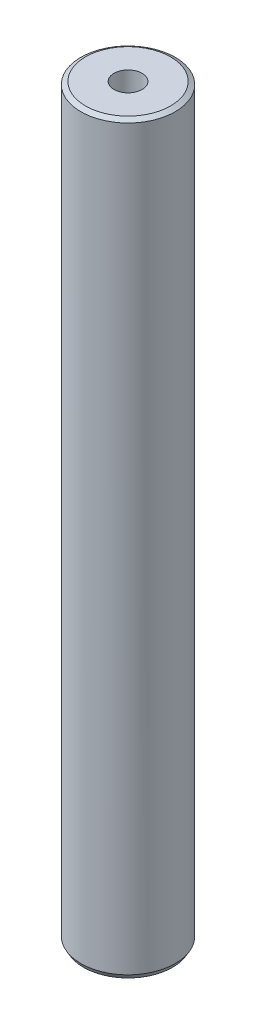
ISO-10303-21;
HEADER;
FILE_DESCRIPTION(('STEP AP214'),'2;1');
FILE_NAME('part.step','',(''),(''),'','','');
FILE_SCHEMA(('AUTOMOTIVE_DESIGN { 1 0 10303 214 1 1 1 1 }'));
ENDSEC;
DATA;
#1=APPLICATION_CONTEXT('core data for automotive mechanical design processes');
#2=APPLICATION_PROTOCOL_DEFINITION('international standard','automotive_design',2000,#1);
#3=PRODUCT_CONTEXT('',#1,'mechanical');
#4=PRODUCT('Part','Part','',(#3));
#5=PRODUCT_RELATED_PRODUCT_CATEGORY('part','',(#4));
#6=PRODUCT_DEFINITION_FORMATION('','',#4);
#7=PRODUCT_DEFINITION_CONTEXT('part definition',#1,'design');
#8=PRODUCT_DEFINITION('design','',#6,#7);
#9=PRODUCT_DEFINITION_SHAPE('','',#8);
#10=(LENGTH_UNIT() NAMED_UNIT(*) SI_UNIT(.MILLI.,.METRE.));
#11=(NAMED_UNIT(*) PLANE_ANGLE_UNIT() SI_UNIT($,.RADIAN.));
#12=(NAMED_UNIT(*) SI_UNIT($,.STERADIAN.) SOLID_ANGLE_UNIT());
#13=UNCERTAINTY_MEASURE_WITH_UNIT(LENGTH_MEASURE(1.E-05),#10,'distance_accuracy_value','');
#14=(GEOMETRIC_REPRESENTATION_CONTEXT(3) GLOBAL_UNCERTAINTY_ASSIGNED_CONTEXT((#13)) GLOBAL_UNIT_ASSIGNED_CONTEXT((#10,
#11,#12)) REPRESENTATION_CONTEXT('',''));
#15=CARTESIAN_POINT('',(0.,0.,0.));
#16=DIRECTION('',(0.,0.,1.));
#17=DIRECTION('',(1.,0.,0.));
#18=AXIS2_PLACEMENT_3D('',#15,#16,#17);
#19=CARTESIAN_POINT('',(0.,591.938683053049,0.));
#20=DIRECTION('',(0.,-1.,0.));
#21=DIRECTION('',(0.,0.,-1.));
#22=AXIS2_PLACEMENT_3D('',#19,#20,#21);
#23=CYLINDRICAL_SURFACE('',#22,37.5);
#24=CARTESIAN_POINT('',(0.,589.81200733896,0.));
#25=DIRECTION('',(0.,1.,0.));
#26=DIRECTION('',(0.,0.,1.));
#27=AXIS2_PLACEMENT_3D('',#24,#25,#26);
#28=CIRCLE('',#27,37.5);
#29=CARTESIAN_POINT('',(0.,589.81200733896,-37.5));
#30=VERTEX_POINT('',#29);
#31=EDGE_CURVE('E50',#30,#30,#28,.F.);
#32=CARTESIAN_POINT('',(0.,3.70015920661737,0.));
#33=DIRECTION('',(0.,1.,0.));
#34=DIRECTION('',(0.,0.,1.));
#35=AXIS2_PLACEMENT_3D('',#32,#33,#34);
#36=CIRCLE('',#35,37.5);
#37=CARTESIAN_POINT('',(0.,3.70015920661737,-37.5));
#38=VERTEX_POINT('',#37);
#39=EDGE_CURVE('E51',#38,#38,#36,.T.);
#40=CARTESIAN_POINT('',(0.,589.81200733896,-37.5));
#41=CARTESIAN_POINT('',(0.,583.706675587581,-37.5));
#42=CARTESIAN_POINT('',(0.,577.601343836203,-37.5));
#43=CARTESIAN_POINT('',(0.,565.390680333446,-37.5));
#44=CARTESIAN_POINT('',(0.,559.285348582067,-37.5));
#45=CARTESIAN_POINT('',(0.,547.07468507931,-37.5));
#46=CARTESIAN_POINT('',(0.,540.969353327931,-37.5));
#47=CARTESIAN_POINT('',(0.,528.758689825174,-37.5));
#48=CARTESIAN_POINT('',(0.,522.653358073796,-37.5));
#49=CARTESIAN_POINT('',(0.,510.442694571039,-37.5));
#50=CARTESIAN_POINT('',(0.,504.33736281966,-37.5));
#51=CARTESIAN_POINT('',(0.,492.126699316903,-37.5));
#52=CARTESIAN_POINT('',(0.,486.021367565524,-37.5));
#53=CARTESIAN_POINT('',(0.,473.810704062767,-37.5));
#54=CARTESIAN_POINT('',(0.,467.705372311389,-37.5));
#55=CARTESIAN_POINT('',(0.,455.494708808632,-37.5));
#56=CARTESIAN_POINT('',(0.,449.389377057253,-37.5));
#57=CARTESIAN_POINT('',(0.,437.178713554496,-37.5));
#58=CARTESIAN_POINT('',(0.,431.073381803117,-37.5));
#59=CARTESIAN_POINT('',(0.,418.86271830036,-37.5));
#60=CARTESIAN_POINT('',(0.,412.757386548982,-37.5));
#61=CARTESIAN_POINT('',(0.,400.546723046224,-37.5));
#62=CARTESIAN_POINT('',(0.,394.441391294846,-37.5));
#63=CARTESIAN_POINT('',(0.,382.230727792089,-37.5));
#64=CARTESIAN_POINT('',(0.,376.12539604071,-37.5));
#65=CARTESIAN_POINT('',(0.,363.914732537953,-37.5));
#66=CARTESIAN_POINT('',(0.,357.809400786574,-37.5));
#67=CARTESIAN_POINT('',(0.,345.598737283817,-37.5));
#68=CARTESIAN_POINT('',(0.,339.493405532439,-37.5));
#69=CARTESIAN_POINT('',(0.,327.282742029682,-37.5));
#70=CARTESIAN_POINT('',(0.,321.177410278303,-37.5));
#71=CARTESIAN_POINT('',(0.,308.966746775546,-37.5));
#72=CARTESIAN_POINT('',(0.,302.861415024167,-37.5));
#73=CARTESIAN_POINT('',(0.,290.65075152141,-37.5));
#74=CARTESIAN_POINT('',(0.,284.545419770032,-37.5));
#75=CARTESIAN_POINT('',(0.,272.334756267274,-37.5));
#76=CARTESIAN_POINT('',(0.,266.229424515896,-37.5));
#77=CARTESIAN_POINT('',(0.,254.018761013139,-37.5));
#78=CARTESIAN_POINT('',(0.,247.91342926176,-37.5));
#79=CARTESIAN_POINT('',(0.,235.702765759003,-37.5));
#80=CARTESIAN_POINT('',(0.,229.597434007624,-37.5));
#81=CARTESIAN_POINT('',(0.,217.386770504867,-37.5));
#82=CARTESIAN_POINT('',(0.,211.281438753489,-37.5));
#83=CARTESIAN_POINT('',(0.,199.070775250732,-37.5));
#84=CARTESIAN_POINT('',(0.,192.965443499353,-37.5));
#85=CARTESIAN_POINT('',(0.,180.754779996596,-37.5));
#86=CARTESIAN_POINT('',(0.,174.649448245217,-37.5));
#87=CARTESIAN_POINT('',(0.,162.43878474246,-37.5));
#88=CARTESIAN_POINT('',(0.,156.333452991082,-37.5));
#89=CARTESIAN_POINT('',(0.,144.122789488324,-37.5));
#90=CARTESIAN_POINT('',(0.,138.017457736946,-37.5));
#91=CARTESIAN_POINT('',(0.,125.806794234189,-37.5));
#92=CARTESIAN_POINT('',(0.,119.70146248281,-37.5));
#93=CARTESIAN_POINT('',(0.,107.490798980053,-37.5));
#94=CARTESIAN_POINT('',(0.,101.385467228674,-37.5));
#95=CARTESIAN_POINT('',(0.,89.1748037259174,-37.5));
#96=CARTESIAN_POINT('',(0.,83.0694719745388,-37.5));
#97=CARTESIAN_POINT('',(0.,70.8588084717817,-37.5));
#98=CARTESIAN_POINT('',(0.,64.7534767204031,-37.5));
#99=CARTESIAN_POINT('',(0.,52.5428132176459,-37.5));
#100=CARTESIAN_POINT('',(0.,46.4374814662673,-37.5));
#101=CARTESIAN_POINT('',(0.,34.2268179635102,-37.5));
#102=CARTESIAN_POINT('',(0.,28.1214862121317,-37.5));
#103=CARTESIAN_POINT('',(0.,15.9108227093745,-37.5));
#104=CARTESIAN_POINT('',(0.,9.80549095799594,-37.5));
#105=CARTESIAN_POINT('',(0.,3.70015920661737,-37.5));
#106=B_SPLINE_CURVE_WITH_KNOTS('',3,(#40,#41,#42,#43,#44,#45,#46,#47,#48,#49,#50,#51,#52,#53,
#54,#55,#56,#57,#58,#59,#60,#61,#62,#63,#64,#65,#66,#67,#68,#69,#70,#71,#72,#73,#74,#75,#76,#77,
#78,#79,#80,#81,#82,#83,#84,#85,#86,#87,#88,#89,#90,#91,#92,#93,#94,#95,#96,#97,#98,#99,#100,
#101,#102,#103,#104,#105),.UNSPECIFIED.,.F.,.F.,(4,2,2,2,2,2,2,2,2,2,2,2,2,2,2,2,2,2,2,2,2,2,2,
2,2,2,2,2,2,2,2,2,4),(0.,18.3159952541356,36.6319905082714,54.9479857624071,73.2639810165427,
91.5799762706785,109.895971524814,128.21196677895,146.527962033086,164.843957287221,
183.159952541357,201.475947795493,219.791943049628,238.107938303764,256.4239335579,
274.739928812036,293.055924066171,311.371919320307,329.687914574443,348.003909828578,
366.319905082714,384.63590033685,402.951895590986,421.267890845121,439.583886099257,
457.899881353393,476.215876607528,494.531871861664,512.8478671158,531.163862369935,
549.479857624071,567.795852878207,586.111848132343),.UNSPECIFIED.);
#107=EDGE_CURVE('BSEAM39',#30,#38,#106,.T.);
#108=ORIENTED_EDGE('',*,*,#31,.T.);
#109=ORIENTED_EDGE('',*,*,#39,.T.);
#110=ORIENTED_EDGE('',*,*,#107,.T.);
#111=ORIENTED_EDGE('',*,*,#107,.F.);
#112=EDGE_LOOP('',(#108,#110,#109,#111));
#113=FACE_BOUND('',#112,.T.);
#114=ADVANCED_FACE('F39',(#113),#23,.T.);
#115=CARTESIAN_POINT('',(0.,591.938683053049,0.));
#116=DIRECTION('',(0.,1.,0.));
#117=DIRECTION('',(0.,0.,1.));
#118=AXIS2_PLACEMENT_3D('',#115,#116,#117);
#119=PLANE('',#118);
#120=CARTESIAN_POINT('',(0.,591.938683053049,0.));
#121=DIRECTION('',(0.,1.,0.));
#122=DIRECTION('',(0.,0.,1.));
#123=AXIS2_PLACEMENT_3D('',#120,#121,#122);
#124=CIRCLE('',#123,33.7998407933843);
#125=CARTESIAN_POINT('',(0.,591.938683053049,33.7998407933843));
#126=VERTEX_POINT('',#125);
#127=EDGE_CURVE('E54',#126,#126,#124,.T.);
#128=ORIENTED_EDGE('',*,*,#127,.T.);
#129=EDGE_LOOP('',(#128));
#130=FACE_BOUND('',#129,.T.);
#131=CARTESIAN_POINT('',(0.,591.938683053049,0.));
#132=DIRECTION('',(0.,1.,0.));
#133=DIRECTION('',(0.,0.,1.));
#134=AXIS2_PLACEMENT_3D('',#131,#132,#133);
#135=CIRCLE('',#134,11.1779495084314);
#136=CARTESIAN_POINT('',(0.,591.938683053049,-11.1779495084314));
#137=VERTEX_POINT('',#136);
#138=EDGE_CURVE('E58',#137,#137,#135,.T.);
#139=ORIENTED_EDGE('',*,*,#138,.F.);
#140=EDGE_LOOP('',(#139));
#141=FACE_BOUND('',#140,.T.);
#142=ADVANCED_FACE('F69',(#130,#141),#119,.T.);
#143=CARTESIAN_POINT('',(0.,0.,0.));
#144=DIRECTION('',(0.,1.,0.));
#145=DIRECTION('',(0.,0.,1.));
#146=AXIS2_PLACEMENT_3D('',#143,#144,#145);
#147=PLANE('',#146);
#148=CARTESIAN_POINT('',(0.,0.,0.));
#149=DIRECTION('',(0.,1.,0.));
#150=DIRECTION('',(0.,0.,1.));
#151=AXIS2_PLACEMENT_3D('',#148,#149,#150);
#152=CIRCLE('',#151,35.3733242859099);
#153=CARTESIAN_POINT('',(0.,0.,35.3733242859099));
#154=VERTEX_POINT('',#153);
#155=EDGE_CURVE('E10',#154,#154,#152,.F.);
#156=ORIENTED_EDGE('',*,*,#155,.T.);
#157=EDGE_LOOP('',(#156));
#158=FACE_BOUND('',#157,.T.);
#159=CARTESIAN_POINT('',(0.,0.,0.));
#160=DIRECTION('',(0.,1.,0.));
#161=DIRECTION('',(0.,0.,1.));
#162=AXIS2_PLACEMENT_3D('',#159,#160,#161);
#163=CIRCLE('',#162,11.1779495084314);
#164=CARTESIAN_POINT('',(0.,-1.11022302462516E-13,-11.1779495084314));
#165=VERTEX_POINT('',#164);
#166=EDGE_CURVE('E63',#165,#165,#163,.T.);
#167=ORIENTED_EDGE('',*,*,#166,.T.);
#168=EDGE_LOOP('',(#167));
#169=FACE_BOUND('',#168,.T.);
#170=ADVANCED_FACE('F75',(#158,#169),#147,.F.);
#171=CARTESIAN_POINT('',(0.,591.938683053049,0.));
#172=DIRECTION('',(0.,-1.,0.));
#173=DIRECTION('',(0.,0.,-1.));
#174=AXIS2_PLACEMENT_3D('',#171,#172,#173);
#175=CYLINDRICAL_SURFACE('',#174,11.1779495084314);
#176=CARTESIAN_POINT('',(0.,591.938683053049,-11.1779495084314));
#177=CARTESIAN_POINT('',(0.,585.77265510458,-11.1779495084314));
#178=CARTESIAN_POINT('',(0.,579.606627156111,-11.1779495084314));
#179=CARTESIAN_POINT('',(0.,567.274571259172,-11.1779495084314));
#180=CARTESIAN_POINT('',(0.,561.108543310703,-11.1779495084314));
#181=CARTESIAN_POINT('',(0.,548.776487413764,-11.1779495084314));
#182=CARTESIAN_POINT('',(0.,542.610459465295,-11.1779495084314));
#183=CARTESIAN_POINT('',(0.,530.278403568357,-11.1779495084314));
#184=CARTESIAN_POINT('',(0.,524.112375619887,-11.1779495084314));
#185=CARTESIAN_POINT('',(0.,511.780319722949,-11.1779495084314));
#186=CARTESIAN_POINT('',(0.,505.61429177448,-11.1779495084314));
#187=CARTESIAN_POINT('',(0.,493.282235877541,-11.1779495084314));
#188=CARTESIAN_POINT('',(0.,487.116207929072,-11.1779495084314));
#189=CARTESIAN_POINT('',(0.,474.784152032133,-11.1779495084314));
#190=CARTESIAN_POINT('',(0.,468.618124083664,-11.1779495084314));
#191=CARTESIAN_POINT('',(0.,456.286068186725,-11.1779495084314));
#192=CARTESIAN_POINT('',(0.,450.120040238256,-11.1779495084314));
#193=CARTESIAN_POINT('',(0.,437.787984341318,-11.1779495084314));
#194=CARTESIAN_POINT('',(0.,431.621956392848,-11.1779495084314));
#195=CARTESIAN_POINT('',(0.,419.28990049591,-11.1779495084314));
#196=CARTESIAN_POINT('',(0.,413.123872547441,-11.1779495084314));
#197=CARTESIAN_POINT('',(0.,400.791816650502,-11.1779495084314));
#198=CARTESIAN_POINT('',(0.,394.625788702033,-11.1779495084314));
#199=CARTESIAN_POINT('',(0.,382.293732805094,-11.1779495084314));
#200=CARTESIAN_POINT('',(0.,376.127704856625,-11.1779495084314));
#201=CARTESIAN_POINT('',(0.,363.795648959686,-11.1779495084314));
#202=CARTESIAN_POINT('',(0.,357.629621011217,-11.1779495084314));
#203=CARTESIAN_POINT('',(0.,345.297565114279,-11.1779495084314));
#204=CARTESIAN_POINT('',(0.,339.131537165809,-11.1779495084314));
#205=CARTESIAN_POINT('',(0.,326.799481268871,-11.1779495084314));
#206=CARTESIAN_POINT('',(0.,320.633453320402,-11.1779495084314));
#207=CARTESIAN_POINT('',(0.,308.301397423463,-11.1779495084314));
#208=CARTESIAN_POINT('',(0.,302.135369474994,-11.1779495084314));
#209=CARTESIAN_POINT('',(0.,289.803313578055,-11.1779495084314));
#210=CARTESIAN_POINT('',(0.,283.637285629586,-11.1779495084314));
#211=CARTESIAN_POINT('',(0.,271.305229732647,-11.1779495084314));
#212=CARTESIAN_POINT('',(0.,265.139201784178,-11.1779495084314));
#213=CARTESIAN_POINT('',(0.,252.80714588724,-11.1779495084314));
#214=CARTESIAN_POINT('',(0.,246.64111793877,-11.1779495084314));
#215=CARTESIAN_POINT('',(0.,234.309062041832,-11.1779495084314));
#216=CARTESIAN_POINT('',(0.,228.143034093363,-11.1779495084314));
#217=CARTESIAN_POINT('',(0.,215.810978196424,-11.1779495084314));
#218=CARTESIAN_POINT('',(0.,209.644950247955,-11.1779495084314));
#219=CARTESIAN_POINT('',(0.,197.312894351016,-11.1779495084314));
#220=CARTESIAN_POINT('',(0.,191.146866402547,-11.1779495084314));
#221=CARTESIAN_POINT('',(0.,178.814810505608,-11.1779495084314));
#222=CARTESIAN_POINT('',(0.,172.648782557139,-11.1779495084314));
#223=CARTESIAN_POINT('',(0.,160.316726660201,-11.1779495084314));
#224=CARTESIAN_POINT('',(0.,154.150698711731,-11.1779495084314));
#225=CARTESIAN_POINT('',(0.,141.818642814793,-11.1779495084314));
#226=CARTESIAN_POINT('',(0.,135.652614866324,-11.1779495084314));
#227=CARTESIAN_POINT('',(0.,123.320558969385,-11.1779495084314));
#228=CARTESIAN_POINT('',(0.,117.154531020916,-11.1779495084314));
#229=CARTESIAN_POINT('',(0.,104.822475123977,-11.1779495084314));
#230=CARTESIAN_POINT('',(0.,98.656447175508,-11.1779495084314));
#231=CARTESIAN_POINT('',(0.,86.3243912785695,-11.1779495084314));
#232=CARTESIAN_POINT('',(0.,80.1583633301003,-11.1779495084314));
#233=CARTESIAN_POINT('',(0.,67.8263074331618,-11.1779495084314));
#234=CARTESIAN_POINT('',(0.,61.6602794846925,-11.1779495084314));
#235=CARTESIAN_POINT('',(0.,49.328223587754,-11.1779495084314));
#236=CARTESIAN_POINT('',(0.,43.1621956392847,-11.1779495084314));
#237=CARTESIAN_POINT('',(0.,30.8301397423462,-11.1779495084314));
#238=CARTESIAN_POINT('',(0.,24.664111793877,-11.1779495084314));
#239=CARTESIAN_POINT('',(0.,12.3320558969385,-11.1779495084314));
#240=CARTESIAN_POINT('',(0.,6.16602794846917,-11.1779495084314));
#241=CARTESIAN_POINT('',(0.,-1.11022302462516E-13,-11.1779495084314));
#242=B_SPLINE_CURVE_WITH_KNOTS('',3,(#176,#177,#178,#179,#180,#181,#182,#183,#184,#185,#186,
#187,#188,#189,#190,#191,#192,#193,#194,#195,#196,#197,#198,#199,#200,#201,#202,#203,#204,#205,
#206,#207,#208,#209,#210,#211,#212,#213,#214,#215,#216,#217,#218,#219,#220,#221,#222,#223,#224,
#225,#226,#227,#228,#229,#230,#231,#232,#233,#234,#235,#236,#237,#238,#239,#240,#241),
.UNSPECIFIED.,.F.,.F.,(4,2,2,2,2,2,2,2,2,2,2,2,2,2,2,2,2,2,2,2,2,2,2,2,2,2,2,2,2,2,2,2,4),(0.,
18.4980838454079,36.9961676908156,55.4942515362235,73.9923353816312,92.490419227039,
110.988503072447,129.486586917855,147.984670763262,166.48275460867,184.980838454078,
203.478922299486,221.977006144894,240.475089990301,258.973173835709,277.471257681117,
295.969341526525,314.467425371933,332.96550921734,351.463593062748,369.961676908156,
388.459760753564,406.957844598972,425.455928444379,443.954012289787,462.452096135195,
480.950179980603,499.448263826011,517.946347671418,536.444431516826,554.942515362234,
573.440599207642,591.938683053049),.UNSPECIFIED.);
#243=EDGE_CURVE('BSEAM70',#137,#165,#242,.T.);
#244=ORIENTED_EDGE('',*,*,#138,.T.);
#245=ORIENTED_EDGE('',*,*,#166,.F.);
#246=ORIENTED_EDGE('',*,*,#243,.T.);
#247=ORIENTED_EDGE('',*,*,#243,.F.);
#248=EDGE_LOOP('',(#244,#246,#245,#247));
#249=FACE_BOUND('',#248,.T.);
#250=ADVANCED_FACE('F70',(#249),#175,.F.);
#251=CARTESIAN_POINT('',(0.,591.938683053049,0.));
#252=DIRECTION('',(0.,-1.,0.));
#253=DIRECTION('',(0.,0.,-1.));
#254=AXIS2_PLACEMENT_3D('',#251,#252,#253);
#255=CONICAL_SURFACE('',#254,33.7998407933843,1.04914807788122);
#256=ORIENTED_EDGE('',*,*,#31,.F.);
#257=EDGE_LOOP('',(#256));
#258=FACE_BOUND('',#257,.T.);
#259=ORIENTED_EDGE('',*,*,#127,.F.);
#260=EDGE_LOOP('',(#259));
#261=FACE_BOUND('',#260,.T.);
#262=ADVANCED_FACE('F81',(#258,#261),#255,.T.);
#263=CARTESIAN_POINT('',(0.,3.70015920661737,0.));
#264=DIRECTION('',(0.,1.,0.));
#265=DIRECTION('',(0.,0.,1.));
#266=AXIS2_PLACEMENT_3D('',#263,#264,#265);
#267=CONICAL_SURFACE('',#266,37.5,0.521648248913664);
#268=ORIENTED_EDGE('',*,*,#155,.F.);
#269=EDGE_LOOP('',(#268));
#270=FACE_BOUND('',#269,.T.);
#271=ORIENTED_EDGE('',*,*,#39,.F.);
#272=EDGE_LOOP('',(#271));
#273=FACE_BOUND('',#272,.T.);
#274=ADVANCED_FACE('F45',(#270,#273),#267,.T.);
#275=CLOSED_SHELL('',(#114,#142,#170,#250,#262,#274));
#276=MANIFOLD_SOLID_BREP('B2',#275);
#277=ADVANCED_BREP_SHAPE_REPRESENTATION('',(#18,#276),#14);
#278=SHAPE_DEFINITION_REPRESENTATION(#9,#277);
ENDSEC;
END-ISO-10303-21;
